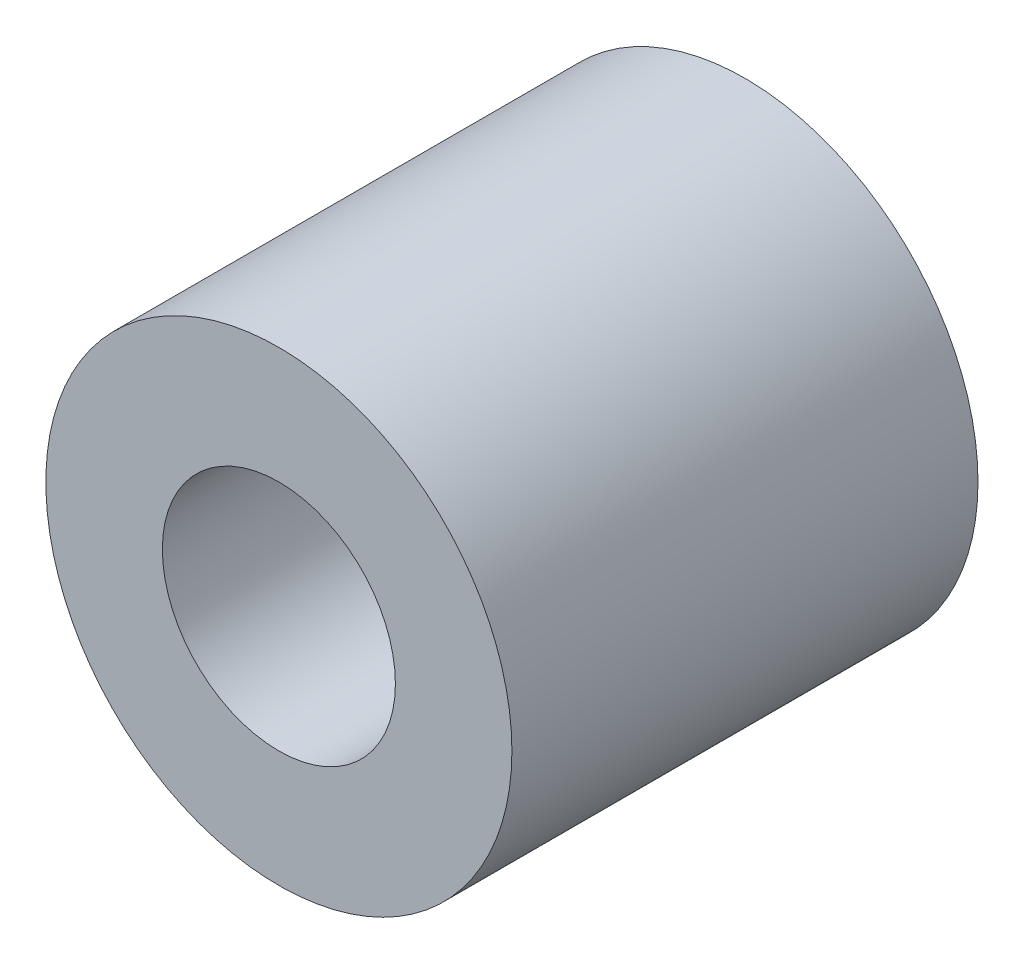
ISO-10303-21;
HEADER;
FILE_DESCRIPTION(('STEP AP214'),'2;1');
FILE_NAME('part.step','',(''),(''),'','','');
FILE_SCHEMA(('AUTOMOTIVE_DESIGN { 1 0 10303 214 1 1 1 1 }'));
ENDSEC;
DATA;
#1=APPLICATION_CONTEXT('core data for automotive mechanical design processes');
#2=APPLICATION_PROTOCOL_DEFINITION('international standard','automotive_design',2000,#1);
#3=PRODUCT_CONTEXT('',#1,'mechanical');
#4=PRODUCT('Part','Part','',(#3));
#5=PRODUCT_RELATED_PRODUCT_CATEGORY('part','',(#4));
#6=PRODUCT_DEFINITION_FORMATION('','',#4);
#7=PRODUCT_DEFINITION_CONTEXT('part definition',#1,'design');
#8=PRODUCT_DEFINITION('design','',#6,#7);
#9=PRODUCT_DEFINITION_SHAPE('','',#8);
#10=(LENGTH_UNIT() NAMED_UNIT(*) SI_UNIT(.MILLI.,.METRE.));
#11=(NAMED_UNIT(*) PLANE_ANGLE_UNIT() SI_UNIT($,.RADIAN.));
#12=(NAMED_UNIT(*) SI_UNIT($,.STERADIAN.) SOLID_ANGLE_UNIT());
#13=UNCERTAINTY_MEASURE_WITH_UNIT(LENGTH_MEASURE(1.E-05),#10,'distance_accuracy_value','');
#14=(GEOMETRIC_REPRESENTATION_CONTEXT(3) GLOBAL_UNCERTAINTY_ASSIGNED_CONTEXT((#13)) GLOBAL_UNIT_ASSIGNED_CONTEXT((#10,
#11,#12)) REPRESENTATION_CONTEXT('',''));
#15=CARTESIAN_POINT('',(0.,0.,0.));
#16=DIRECTION('',(0.,0.,1.));
#17=DIRECTION('',(1.,0.,0.));
#18=AXIS2_PLACEMENT_3D('',#15,#16,#17);
#19=CARTESIAN_POINT('',(0.,0.,5.));
#20=DIRECTION('',(0.,0.,-1.));
#21=DIRECTION('',(-1.,0.,0.));
#22=AXIS2_PLACEMENT_3D('',#19,#20,#21);
#23=CYLINDRICAL_SURFACE('',#22,2.5);
#24=CARTESIAN_POINT('',(0.,0.,5.));
#25=DIRECTION('',(0.,0.,1.));
#26=DIRECTION('',(1.,0.,0.));
#27=AXIS2_PLACEMENT_3D('',#24,#25,#26);
#28=CIRCLE('',#27,2.5);
#29=CARTESIAN_POINT('',(2.5,0.,5.));
#30=VERTEX_POINT('',#29);
#31=EDGE_CURVE('E10',#30,#30,#28,.T.);
#32=ORIENTED_EDGE('',*,*,#31,.F.);
#33=EDGE_LOOP('',(#32));
#34=FACE_BOUND('',#33,.T.);
#35=CARTESIAN_POINT('',(0.,0.,0.));
#36=DIRECTION('',(0.,0.,1.));
#37=DIRECTION('',(1.,0.,0.));
#38=AXIS2_PLACEMENT_3D('',#35,#36,#37);
#39=CIRCLE('',#38,2.5);
#40=CARTESIAN_POINT('',(2.5,0.,0.));
#41=VERTEX_POINT('',#40);
#42=EDGE_CURVE('E54',#41,#41,#39,.T.);
#43=ORIENTED_EDGE('',*,*,#42,.T.);
#44=EDGE_LOOP('',(#43));
#45=FACE_BOUND('',#44,.T.);
#46=ADVANCED_FACE('F51',(#34,#45),#23,.T.);
#47=CARTESIAN_POINT('',(0.,0.,5.));
#48=DIRECTION('',(0.,0.,1.));
#49=DIRECTION('',(1.,0.,0.));
#50=AXIS2_PLACEMENT_3D('',#47,#48,#49);
#51=PLANE('',#50);
#52=CARTESIAN_POINT('',(0.,0.,5.));
#53=DIRECTION('',(0.,0.,1.));
#54=DIRECTION('',(1.,0.,0.));
#55=AXIS2_PLACEMENT_3D('',#52,#53,#54);
#56=CIRCLE('',#55,1.24999999999999);
#57=CARTESIAN_POINT('',(1.24999999999999,0.,5.));
#58=VERTEX_POINT('',#57);
#59=EDGE_CURVE('E68',#58,#58,#56,.T.);
#60=ORIENTED_EDGE('',*,*,#59,.F.);
#61=EDGE_LOOP('',(#60));
#62=FACE_BOUND('',#61,.T.);
#63=ORIENTED_EDGE('',*,*,#31,.T.);
#64=EDGE_LOOP('',(#63));
#65=FACE_BOUND('',#64,.T.);
#66=ADVANCED_FACE('F75',(#62,#65),#51,.T.);
#67=CARTESIAN_POINT('',(0.,0.,0.));
#68=DIRECTION('',(0.,0.,1.));
#69=DIRECTION('',(1.,0.,0.));
#70=AXIS2_PLACEMENT_3D('',#67,#68,#69);
#71=PLANE('',#70);
#72=CARTESIAN_POINT('',(0.,0.,0.));
#73=DIRECTION('',(0.,0.,1.));
#74=DIRECTION('',(1.,0.,0.));
#75=AXIS2_PLACEMENT_3D('',#72,#73,#74);
#76=CIRCLE('',#75,1.24999999999999);
#77=CARTESIAN_POINT('',(1.24999999999999,0.,0.));
#78=VERTEX_POINT('',#77);
#79=EDGE_CURVE('E63',#78,#78,#76,.T.);
#80=ORIENTED_EDGE('',*,*,#79,.T.);
#81=EDGE_LOOP('',(#80));
#82=FACE_BOUND('',#81,.T.);
#83=ORIENTED_EDGE('',*,*,#42,.F.);
#84=EDGE_LOOP('',(#83));
#85=FACE_BOUND('',#84,.T.);
#86=ADVANCED_FACE('F77',(#82,#85),#71,.F.);
#87=CARTESIAN_POINT('',(0.,0.,5.));
#88=DIRECTION('',(0.,0.,1.));
#89=DIRECTION('',(1.,0.,0.));
#90=AXIS2_PLACEMENT_3D('',#87,#88,#89);
#91=CYLINDRICAL_SURFACE('',#90,1.24999999999999);
#92=ORIENTED_EDGE('',*,*,#79,.F.);
#93=EDGE_LOOP('',(#92));
#94=FACE_BOUND('',#93,.T.);
#95=ORIENTED_EDGE('',*,*,#59,.T.);
#96=EDGE_LOOP('',(#95));
#97=FACE_BOUND('',#96,.T.);
#98=ADVANCED_FACE('F73',(#94,#97),#91,.F.);
#99=CLOSED_SHELL('',(#46,#66,#86,#98));
#100=MANIFOLD_SOLID_BREP('B2',#99);
#101=ADVANCED_BREP_SHAPE_REPRESENTATION('',(#18,#100),#14);
#102=SHAPE_DEFINITION_REPRESENTATION(#9,#101);
ENDSEC;
END-ISO-10303-21;
